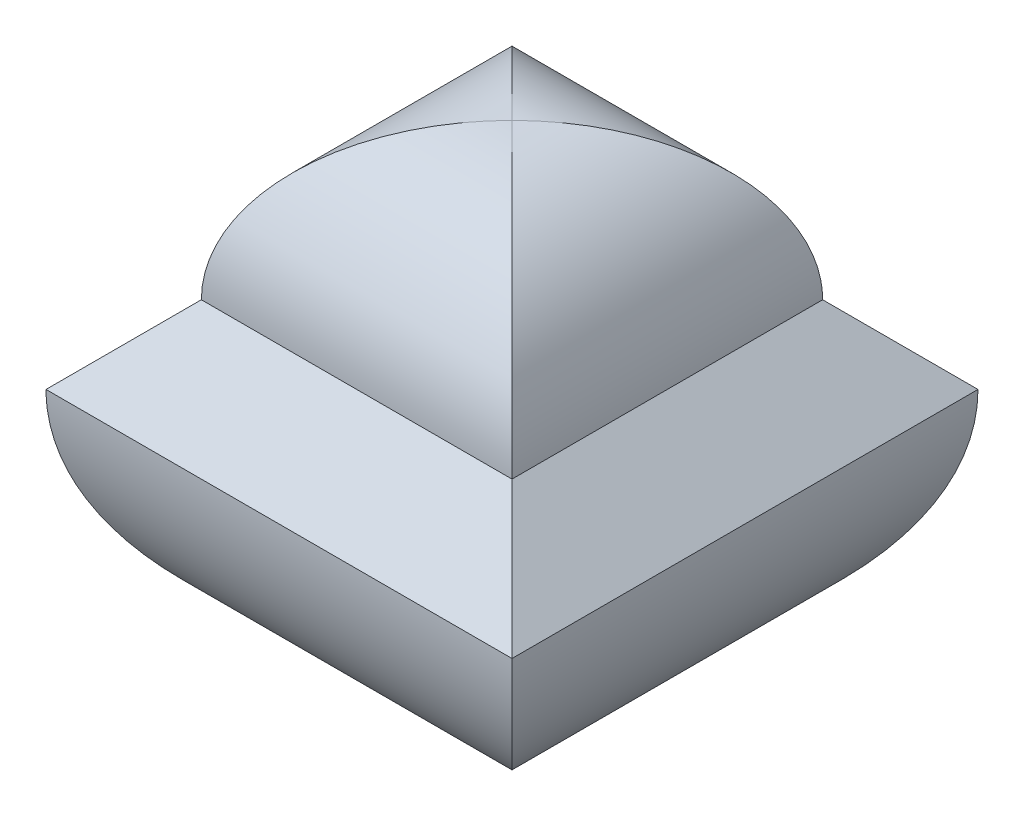
ISO-10303-21;
HEADER;
FILE_DESCRIPTION(('STEP AP214'),'2;1');
FILE_NAME('part.step','',(''),(''),'','','');
FILE_SCHEMA(('AUTOMOTIVE_DESIGN { 1 0 10303 214 1 1 1 1 }'));
ENDSEC;
DATA;
#1=APPLICATION_CONTEXT('core data for automotive mechanical design processes');
#2=APPLICATION_PROTOCOL_DEFINITION('international standard','automotive_design',2000,#1);
#3=PRODUCT_CONTEXT('',#1,'mechanical');
#4=PRODUCT('Part','Part','',(#3));
#5=PRODUCT_RELATED_PRODUCT_CATEGORY('part','',(#4));
#6=PRODUCT_DEFINITION_FORMATION('','',#4);
#7=PRODUCT_DEFINITION_CONTEXT('part definition',#1,'design');
#8=PRODUCT_DEFINITION('design','',#6,#7);
#9=PRODUCT_DEFINITION_SHAPE('','',#8);
#10=(LENGTH_UNIT() NAMED_UNIT(*) SI_UNIT(.MILLI.,.METRE.));
#11=(NAMED_UNIT(*) PLANE_ANGLE_UNIT() SI_UNIT($,.RADIAN.));
#12=(NAMED_UNIT(*) SI_UNIT($,.STERADIAN.) SOLID_ANGLE_UNIT());
#13=UNCERTAINTY_MEASURE_WITH_UNIT(LENGTH_MEASURE(1.E-05),#10,'distance_accuracy_value','');
#14=(GEOMETRIC_REPRESENTATION_CONTEXT(3) GLOBAL_UNCERTAINTY_ASSIGNED_CONTEXT((#13)) GLOBAL_UNIT_ASSIGNED_CONTEXT((#10,
#11,#12)) REPRESENTATION_CONTEXT('',''));
#15=CARTESIAN_POINT('',(0.,0.,0.));
#16=DIRECTION('',(0.,0.,1.));
#17=DIRECTION('',(1.,0.,0.));
#18=AXIS2_PLACEMENT_3D('',#15,#16,#17);
#19=CARTESIAN_POINT('',(0.,0.,60.));
#20=DIRECTION('',(0.,0.,-1.));
#21=DIRECTION('',(-1.,0.,0.));
#22=AXIS2_PLACEMENT_3D('',#19,#20,#21);
#23=CYLINDRICAL_SURFACE('',#22,30.);
#24=DIRECTION('',(0.,0.,-1.));
#25=VECTOR('',#24,1.);
#26=CARTESIAN_POINT('',(-30.,0.,60.));
#27=LINE('',#26,#25);
#28=CARTESIAN_POINT('',(-30.,0.,60.));
#29=VERTEX_POINT('',#28);
#30=CARTESIAN_POINT('',(-30.,0.,0.));
#31=VERTEX_POINT('',#30);
#32=EDGE_CURVE('E178',#29,#31,#27,.T.);
#33=ORIENTED_EDGE('',*,*,#32,.T.);
#34=CARTESIAN_POINT('',(0.,0.,30.));
#35=DIRECTION('',(0.707106781186547,0.,-0.707106781186547));
#36=DIRECTION('',(-0.707106781186547,0.,-0.707106781186547));
#37=AXIS2_PLACEMENT_3D('',#34,#35,#36);
#38=ELLIPSE('',#37,42.4264068711928,30.);
#39=CARTESIAN_POINT('',(0.,-30.,30.));
#40=VERTEX_POINT('',#39);
#41=EDGE_CURVE('E132',#31,#40,#38,.F.);
#42=ORIENTED_EDGE('',*,*,#41,.T.);
#43=CARTESIAN_POINT('',(0.,0.,30.));
#44=DIRECTION('',(-0.707106781186547,0.,-0.707106781186547));
#45=DIRECTION('',(0.707106781186547,0.,-0.707106781186547));
#46=AXIS2_PLACEMENT_3D('',#43,#44,#45);
#47=ELLIPSE('',#46,42.4264068711928,30.);
#48=EDGE_CURVE('E175',#40,#29,#47,.T.);
#49=ORIENTED_EDGE('',*,*,#48,.T.);
#50=EDGE_LOOP('',(#33,#42,#49));
#51=FACE_BOUND('',#50,.T.);
#52=ADVANCED_FACE('F117',(#51),#23,.T.);
#53=CARTESIAN_POINT('',(0.,10.,60.));
#54=DIRECTION('',(0.,0.,-1.));
#55=DIRECTION('',(-1.,0.,0.));
#56=AXIS2_PLACEMENT_3D('',#53,#54,#55);
#57=CYLINDRICAL_SURFACE('',#56,20.);
#58=CARTESIAN_POINT('',(0.,10.,30.));
#59=DIRECTION('',(-0.707106781186547,0.,-0.707106781186547));
#60=DIRECTION('',(0.707106781186547,0.,-0.707106781186547));
#61=AXIS2_PLACEMENT_3D('',#58,#59,#60);
#62=ELLIPSE('',#61,28.2842712474619,20.);
#63=CARTESIAN_POINT('',(0.,30.,30.));
#64=VERTEX_POINT('',#63);
#65=CARTESIAN_POINT('',(20.,10.,10.));
#66=VERTEX_POINT('',#65);
#67=EDGE_CURVE('E213',#64,#66,#62,.T.);
#68=ORIENTED_EDGE('',*,*,#67,.F.);
#69=CARTESIAN_POINT('',(0.,10.,30.));
#70=DIRECTION('',(0.707106781186547,0.,-0.707106781186547));
#71=DIRECTION('',(-0.707106781186547,0.,-0.707106781186547));
#72=AXIS2_PLACEMENT_3D('',#69,#70,#71);
#73=ELLIPSE('',#72,28.2842712474619,20.);
#74=CARTESIAN_POINT('',(20.,10.,50.));
#75=VERTEX_POINT('',#74);
#76=EDGE_CURVE('E199',#64,#75,#73,.T.);
#77=ORIENTED_EDGE('',*,*,#76,.T.);
#78=DIRECTION('',(0.,0.,-1.));
#79=VECTOR('',#78,1.);
#80=CARTESIAN_POINT('',(20.,10.,60.));
#81=LINE('',#80,#79);
#82=EDGE_CURVE('E218',#75,#66,#81,.T.);
#83=ORIENTED_EDGE('',*,*,#82,.T.);
#84=EDGE_LOOP('',(#68,#77,#83));
#85=FACE_BOUND('',#84,.T.);
#86=ADVANCED_FACE('F233',(#85),#57,.T.);
#87=DIRECTION('',(0.,0.,-1.));
#88=VECTOR('',#87,1.);
#89=CARTESIAN_POINT('',(-20.,10.,60.));
#90=LINE('',#89,#88);
#91=CARTESIAN_POINT('',(-20.,10.,50.));
#92=VERTEX_POINT('',#91);
#93=CARTESIAN_POINT('',(-20.,10.,10.));
#94=VERTEX_POINT('',#93);
#95=EDGE_CURVE('E140',#92,#94,#90,.T.);
#96=ORIENTED_EDGE('',*,*,#95,.F.);
#97=CARTESIAN_POINT('',(0.,10.,30.));
#98=DIRECTION('',(-0.707106781186547,0.,-0.707106781186547));
#99=DIRECTION('',(0.707106781186547,0.,-0.707106781186547));
#100=AXIS2_PLACEMENT_3D('',#97,#98,#99);
#101=ELLIPSE('',#100,28.2842712474619,20.);
#102=EDGE_CURVE('E196',#92,#64,#101,.T.);
#103=ORIENTED_EDGE('',*,*,#102,.T.);
#104=CARTESIAN_POINT('',(0.,10.,30.));
#105=DIRECTION('',(0.707106781186547,0.,-0.707106781186547));
#106=DIRECTION('',(-0.707106781186547,0.,-0.707106781186547));
#107=AXIS2_PLACEMENT_3D('',#104,#105,#106);
#108=ELLIPSE('',#107,28.2842712474619,20.);
#109=EDGE_CURVE('E210',#94,#64,#108,.T.);
#110=ORIENTED_EDGE('',*,*,#109,.F.);
#111=EDGE_LOOP('',(#96,#103,#110));
#112=FACE_BOUND('',#111,.T.);
#113=ADVANCED_FACE('F228',(#112),#57,.T.);
#114=CARTESIAN_POINT('',(0.,0.,30.));
#115=DIRECTION('',(0.707106781186547,0.,-0.707106781186547));
#116=DIRECTION('',(-0.707106781186547,0.,-0.707106781186547));
#117=AXIS2_PLACEMENT_3D('',#114,#115,#116);
#118=ELLIPSE('',#117,42.4264068711928,30.);
#119=CARTESIAN_POINT('',(30.,0.,60.));
#120=VERTEX_POINT('',#119);
#121=EDGE_CURVE('E169',#120,#40,#118,.T.);
#122=ORIENTED_EDGE('',*,*,#121,.T.);
#123=CARTESIAN_POINT('',(0.,0.,30.));
#124=DIRECTION('',(-0.707106781186547,0.,-0.707106781186547));
#125=DIRECTION('',(0.707106781186547,0.,-0.707106781186547));
#126=AXIS2_PLACEMENT_3D('',#123,#124,#125);
#127=ELLIPSE('',#126,42.4264068711928,30.);
#128=CARTESIAN_POINT('',(30.,0.,0.));
#129=VERTEX_POINT('',#128);
#130=EDGE_CURVE('E163',#40,#129,#127,.F.);
#131=ORIENTED_EDGE('',*,*,#130,.T.);
#132=DIRECTION('',(0.,0.,-1.));
#133=VECTOR('',#132,1.);
#134=CARTESIAN_POINT('',(30.,0.,60.));
#135=LINE('',#134,#133);
#136=EDGE_CURVE('E186',#120,#129,#135,.T.);
#137=ORIENTED_EDGE('',*,*,#136,.F.);
#138=EDGE_LOOP('',(#122,#131,#137));
#139=FACE_BOUND('',#138,.T.);
#140=ADVANCED_FACE('F119',(#139),#23,.T.);
#141=CARTESIAN_POINT('',(30.,0.,60.));
#142=DIRECTION('',(-0.707106781186547,-0.707106781186548,0.));
#143=DIRECTION('',(0.707106781186548,-0.707106781186547,0.));
#144=AXIS2_PLACEMENT_3D('',#141,#142,#143);
#145=PLANE('',#144);
#146=ORIENTED_EDGE('',*,*,#82,.F.);
#147=DIRECTION('',(0.577350269189626,-0.577350269189626,0.577350269189626));
#148=VECTOR('',#147,1.);
#149=CARTESIAN_POINT('',(30.,0.,60.));
#150=LINE('',#149,#148);
#151=EDGE_CURVE('E193',#75,#120,#150,.T.);
#152=ORIENTED_EDGE('',*,*,#151,.T.);
#153=ORIENTED_EDGE('',*,*,#136,.T.);
#154=DIRECTION('',(-0.577350269189626,0.577350269189626,0.577350269189626));
#155=VECTOR('',#154,1.);
#156=CARTESIAN_POINT('',(10.,20.,20.));
#157=LINE('',#156,#155);
#158=EDGE_CURVE('E207',#129,#66,#157,.T.);
#159=ORIENTED_EDGE('',*,*,#158,.T.);
#160=EDGE_LOOP('',(#146,#152,#153,#159));
#161=FACE_BOUND('',#160,.T.);
#162=ADVANCED_FACE('F236',(#161),#145,.F.);
#163=CARTESIAN_POINT('',(-30.,0.,60.));
#164=DIRECTION('',(0.707106781186548,-0.707106781186547,0.));
#165=DIRECTION('',(0.707106781186547,0.707106781186548,0.));
#166=AXIS2_PLACEMENT_3D('',#163,#164,#165);
#167=PLANE('',#166);
#168=ORIENTED_EDGE('',*,*,#32,.F.);
#169=DIRECTION('',(0.577350269189626,0.577350269189626,-0.577350269189626));
#170=VECTOR('',#169,1.);
#171=CARTESIAN_POINT('',(-30.,0.,60.));
#172=LINE('',#171,#170);
#173=EDGE_CURVE('E191',#29,#92,#172,.T.);
#174=ORIENTED_EDGE('',*,*,#173,.T.);
#175=ORIENTED_EDGE('',*,*,#95,.T.);
#176=DIRECTION('',(-0.577350269189626,-0.577350269189626,-0.577350269189626));
#177=VECTOR('',#176,1.);
#178=CARTESIAN_POINT('',(-10.,20.,20.));
#179=LINE('',#178,#177);
#180=EDGE_CURVE('E205',#94,#31,#179,.T.);
#181=ORIENTED_EDGE('',*,*,#180,.T.);
#182=EDGE_LOOP('',(#168,#174,#175,#181));
#183=FACE_BOUND('',#182,.T.);
#184=ADVANCED_FACE('F223',(#183),#167,.F.);
#185=CARTESIAN_POINT('',(60.,10.,30.));
#186=DIRECTION('',(-1.,0.,0.));
#187=DIRECTION('',(0.,0.,1.));
#188=AXIS2_PLACEMENT_3D('',#185,#186,#187);
#189=CYLINDRICAL_SURFACE('',#188,20.);
#190=ORIENTED_EDGE('',*,*,#67,.T.);
#191=DIRECTION('',(-1.,0.,0.));
#192=VECTOR('',#191,1.);
#193=CARTESIAN_POINT('',(60.,10.,10.));
#194=LINE('',#193,#192);
#195=EDGE_CURVE('E202',#66,#94,#194,.T.);
#196=ORIENTED_EDGE('',*,*,#195,.T.);
#197=ORIENTED_EDGE('',*,*,#109,.T.);
#198=EDGE_LOOP('',(#190,#196,#197));
#199=FACE_BOUND('',#198,.T.);
#200=ADVANCED_FACE('F231',(#199),#189,.T.);
#201=CARTESIAN_POINT('',(60.,0.,0.));
#202=DIRECTION('',(0.,-0.707106781186547,0.707106781186548));
#203=DIRECTION('',(0.,-0.707106781186548,-0.707106781186547));
#204=AXIS2_PLACEMENT_3D('',#201,#202,#203);
#205=PLANE('',#204);
#206=DIRECTION('',(-1.,0.,0.));
#207=VECTOR('',#206,1.);
#208=CARTESIAN_POINT('',(0.,0.,0.));
#209=LINE('',#208,#207);
#210=EDGE_CURVE('E125',#129,#31,#209,.T.);
#211=ORIENTED_EDGE('',*,*,#210,.T.);
#212=ORIENTED_EDGE('',*,*,#180,.F.);
#213=ORIENTED_EDGE('',*,*,#195,.F.);
#214=ORIENTED_EDGE('',*,*,#158,.F.);
#215=EDGE_LOOP('',(#211,#212,#213,#214));
#216=FACE_BOUND('',#215,.T.);
#217=ADVANCED_FACE('F221',(#216),#205,.F.);
#218=CARTESIAN_POINT('',(-60.,10.,30.));
#219=DIRECTION('',(1.,0.,0.));
#220=DIRECTION('',(0.,0.,-1.));
#221=AXIS2_PLACEMENT_3D('',#218,#219,#220);
#222=CYLINDRICAL_SURFACE('',#221,20.);
#223=ORIENTED_EDGE('',*,*,#102,.F.);
#224=DIRECTION('',(1.,0.,0.));
#225=VECTOR('',#224,1.);
#226=CARTESIAN_POINT('',(-60.,10.,50.));
#227=LINE('',#226,#225);
#228=EDGE_CURVE('E183',#92,#75,#227,.T.);
#229=ORIENTED_EDGE('',*,*,#228,.T.);
#230=ORIENTED_EDGE('',*,*,#76,.F.);
#231=EDGE_LOOP('',(#223,#229,#230));
#232=FACE_BOUND('',#231,.T.);
#233=ADVANCED_FACE('F239',(#232),#222,.T.);
#234=CARTESIAN_POINT('',(-60.,30.,30.));
#235=DIRECTION('',(0.,-0.707106781186547,-0.707106781186547));
#236=DIRECTION('',(0.,0.707106781186548,-0.707106781186548));
#237=AXIS2_PLACEMENT_3D('',#234,#235,#236);
#238=PLANE('',#237);
#239=ORIENTED_EDGE('',*,*,#228,.F.);
#240=ORIENTED_EDGE('',*,*,#173,.F.);
#241=DIRECTION('',(-1.,0.,0.));
#242=VECTOR('',#241,1.);
#243=CARTESIAN_POINT('',(0.,0.,60.));
#244=LINE('',#243,#242);
#245=EDGE_CURVE('E12',#120,#29,#244,.T.);
#246=ORIENTED_EDGE('',*,*,#245,.F.);
#247=ORIENTED_EDGE('',*,*,#151,.F.);
#248=EDGE_LOOP('',(#239,#240,#246,#247));
#249=FACE_BOUND('',#248,.T.);
#250=ADVANCED_FACE('F237',(#249),#238,.F.);
#251=CARTESIAN_POINT('',(60.,0.,30.));
#252=DIRECTION('',(-1.,0.,0.));
#253=DIRECTION('',(0.,0.,1.));
#254=AXIS2_PLACEMENT_3D('',#251,#252,#253);
#255=CYLINDRICAL_SURFACE('',#254,30.);
#256=ORIENTED_EDGE('',*,*,#121,.F.);
#257=ORIENTED_EDGE('',*,*,#245,.T.);
#258=ORIENTED_EDGE('',*,*,#48,.F.);
#259=EDGE_LOOP('',(#256,#257,#258));
#260=FACE_BOUND('',#259,.T.);
#261=ADVANCED_FACE('F181',(#260),#255,.T.);
#262=CARTESIAN_POINT('',(60.,0.,30.));
#263=DIRECTION('',(-1.,0.,0.));
#264=DIRECTION('',(0.,0.,1.));
#265=AXIS2_PLACEMENT_3D('',#262,#263,#264);
#266=CYLINDRICAL_SURFACE('',#265,30.);
#267=ORIENTED_EDGE('',*,*,#41,.F.);
#268=ORIENTED_EDGE('',*,*,#210,.F.);
#269=ORIENTED_EDGE('',*,*,#130,.F.);
#270=EDGE_LOOP('',(#267,#268,#269));
#271=FACE_BOUND('',#270,.T.);
#272=ADVANCED_FACE('F164',(#271),#266,.T.);
#273=CLOSED_SHELL('',(#52,#86,#113,#140,#162,#184,#200,#217,#233,#250,#261,#272));
#274=MANIFOLD_SOLID_BREP('B2',#273);
#275=ADVANCED_BREP_SHAPE_REPRESENTATION('',(#18,#274),#14);
#276=SHAPE_DEFINITION_REPRESENTATION(#9,#275);
ENDSEC;
END-ISO-10303-21;
